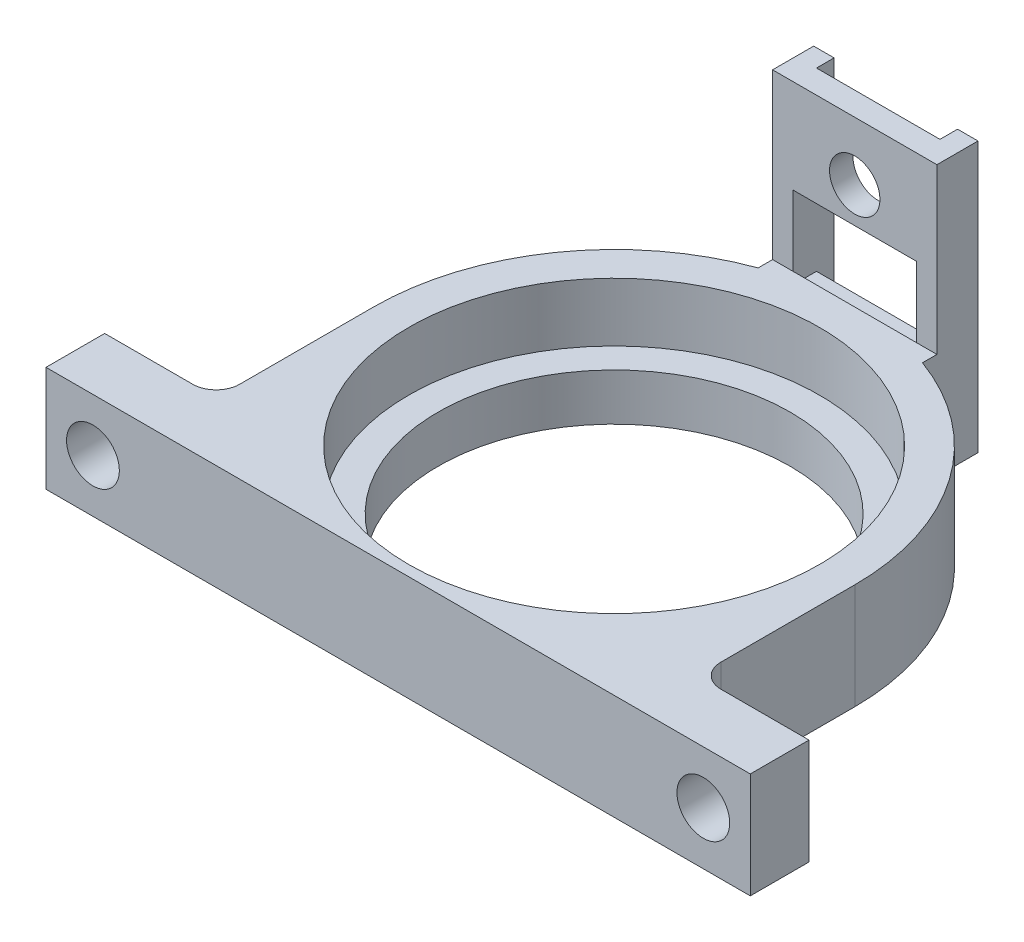
ISO-10303-21;
HEADER;
FILE_DESCRIPTION(('STEP AP214'),'2;1');
FILE_NAME('part.step','',(''),(''),'','','');
FILE_SCHEMA(('AUTOMOTIVE_DESIGN { 1 0 10303 214 1 1 1 1 }'));
ENDSEC;
DATA;
#1=APPLICATION_CONTEXT('core data for automotive mechanical design processes');
#2=APPLICATION_PROTOCOL_DEFINITION('international standard','automotive_design',2000,#1);
#3=PRODUCT_CONTEXT('',#1,'mechanical');
#4=PRODUCT('Part','Part','',(#3));
#5=PRODUCT_RELATED_PRODUCT_CATEGORY('part','',(#4));
#6=PRODUCT_DEFINITION_FORMATION('','',#4);
#7=PRODUCT_DEFINITION_CONTEXT('part definition',#1,'design');
#8=PRODUCT_DEFINITION('design','',#6,#7);
#9=PRODUCT_DEFINITION_SHAPE('','',#8);
#10=(LENGTH_UNIT() NAMED_UNIT(*) SI_UNIT(.MILLI.,.METRE.));
#11=(NAMED_UNIT(*) PLANE_ANGLE_UNIT() SI_UNIT($,.RADIAN.));
#12=(NAMED_UNIT(*) SI_UNIT($,.STERADIAN.) SOLID_ANGLE_UNIT());
#13=UNCERTAINTY_MEASURE_WITH_UNIT(LENGTH_MEASURE(1.E-05),#10,'distance_accuracy_value','');
#14=(GEOMETRIC_REPRESENTATION_CONTEXT(3) GLOBAL_UNCERTAINTY_ASSIGNED_CONTEXT((#13)) GLOBAL_UNIT_ASSIGNED_CONTEXT((#10,
#11,#12)) REPRESENTATION_CONTEXT('',''));
#15=CARTESIAN_POINT('',(0.,0.,0.));
#16=DIRECTION('',(0.,0.,1.));
#17=DIRECTION('',(1.,0.,0.));
#18=AXIS2_PLACEMENT_3D('',#15,#16,#17);
#19=CARTESIAN_POINT('',(5.26,19.7781343320499,-40.9));
#20=DIRECTION('',(0.,0.,-1.));
#21=DIRECTION('',(-1.,0.,0.));
#22=AXIS2_PLACEMENT_3D('',#19,#20,#21);
#23=PLANE('',#22);
#24=DIRECTION('',(1.,0.,0.));
#25=VECTOR('',#24,1.);
#26=CARTESIAN_POINT('',(5.26,11.,-40.9));
#27=LINE('',#26,#25);
#28=CARTESIAN_POINT('',(-5.26,11.,-40.9));
#29=VERTEX_POINT('',#28);
#30=CARTESIAN_POINT('',(5.26,11.,-40.9));
#31=VERTEX_POINT('',#30);
#32=EDGE_CURVE('E50',#29,#31,#27,.T.);
#33=ORIENTED_EDGE('',*,*,#32,.F.);
#34=DIRECTION('',(0.,-1.,0.));
#35=VECTOR('',#34,1.);
#36=CARTESIAN_POINT('',(-5.26,19.7781343320499,-40.9));
#37=LINE('',#36,#35);
#38=CARTESIAN_POINT('',(-5.26,19.,-40.9));
#39=VERTEX_POINT('',#38);
#40=EDGE_CURVE('E230',#39,#29,#37,.T.);
#41=ORIENTED_EDGE('',*,*,#40,.F.);
#42=DIRECTION('',(-1.,0.,0.));
#43=VECTOR('',#42,1.);
#44=CARTESIAN_POINT('',(-5.26,19.,-40.9));
#45=LINE('',#44,#43);
#46=CARTESIAN_POINT('',(5.26,19.,-40.9));
#47=VERTEX_POINT('',#46);
#48=EDGE_CURVE('E373',#47,#39,#45,.T.);
#49=ORIENTED_EDGE('',*,*,#48,.F.);
#50=DIRECTION('',(0.,-1.,0.));
#51=VECTOR('',#50,1.);
#52=CARTESIAN_POINT('',(5.26,19.7781343320499,-40.9));
#53=LINE('',#52,#51);
#54=EDGE_CURVE('E229',#47,#31,#53,.T.);
#55=ORIENTED_EDGE('',*,*,#54,.T.);
#56=EDGE_LOOP('',(#33,#41,#49,#55));
#57=FACE_BOUND('',#56,.T.);
#58=CARTESIAN_POINT('',(0.,14.,-40.9));
#59=DIRECTION('',(0.,0.,-1.));
#60=DIRECTION('',(-1.,0.,0.));
#61=AXIS2_PLACEMENT_3D('',#58,#59,#60);
#62=CIRCLE('',#61,2.1463);
#63=CARTESIAN_POINT('',(-2.1463,14.,-40.9));
#64=VERTEX_POINT('',#63);
#65=EDGE_CURVE('E351',#64,#64,#62,.T.);
#66=ORIENTED_EDGE('',*,*,#65,.F.);
#67=EDGE_LOOP('',(#66));
#68=FACE_BOUND('',#67,.T.);
#69=ADVANCED_FACE('F35',(#57,#68),#23,.T.);
#70=CARTESIAN_POINT('',(0.,5.,-18.4));
#71=DIRECTION('',(0.,-1.,0.));
#72=DIRECTION('',(0.,0.,-1.));
#73=AXIS2_PLACEMENT_3D('',#70,#71,#72);
#74=CYLINDRICAL_SURFACE('',#73,20.5);
#75=DIRECTION('',(0.,-1.,0.));
#76=VECTOR('',#75,1.);
#77=CARTESIAN_POINT('',(-7.,19.7781343320499,-37.6678488679977));
#78=LINE('',#77,#76);
#79=CARTESIAN_POINT('',(-7.,5.,-37.6678488679977));
#80=VERTEX_POINT('',#79);
#81=CARTESIAN_POINT('',(-7.,-4.,-37.6678488679977));
#82=VERTEX_POINT('',#81);
#83=EDGE_CURVE('E243',#80,#82,#78,.T.);
#84=ORIENTED_EDGE('',*,*,#83,.T.);
#85=CARTESIAN_POINT('',(0.,-4.,-18.4));
#86=DIRECTION('',(0.,-1.,0.));
#87=DIRECTION('',(0.,0.,-1.));
#88=AXIS2_PLACEMENT_3D('',#85,#86,#87);
#89=CIRCLE('',#88,20.5);
#90=CARTESIAN_POINT('',(-20.5,-4.,-18.4));
#91=VERTEX_POINT('',#90);
#92=EDGE_CURVE('E264',#91,#82,#89,.T.);
#93=ORIENTED_EDGE('',*,*,#92,.F.);
#94=DIRECTION('',(0.,-1.,0.));
#95=VECTOR('',#94,1.);
#96=CARTESIAN_POINT('',(-20.5,5.,-18.4));
#97=LINE('',#96,#95);
#98=CARTESIAN_POINT('',(-20.5,5.,-18.4));
#99=VERTEX_POINT('',#98);
#100=EDGE_CURVE('E327',#99,#91,#97,.T.);
#101=ORIENTED_EDGE('',*,*,#100,.F.);
#102=CARTESIAN_POINT('',(0.,5.,-18.4));
#103=DIRECTION('',(0.,1.,0.));
#104=DIRECTION('',(0.,0.,1.));
#105=AXIS2_PLACEMENT_3D('',#102,#103,#104);
#106=CIRCLE('',#105,20.5);
#107=EDGE_CURVE('E291',#99,#80,#106,.F.);
#108=ORIENTED_EDGE('',*,*,#107,.T.);
#109=EDGE_LOOP('',(#84,#93,#101,#108));
#110=FACE_BOUND('',#109,.T.);
#111=ADVANCED_FACE('F462',(#110),#74,.T.);
#112=CARTESIAN_POINT('',(0.,5.,-5.));
#113=DIRECTION('',(0.,0.,1.));
#114=DIRECTION('',(1.,0.,0.));
#115=AXIS2_PLACEMENT_3D('',#112,#113,#114);
#116=PLANE('',#115);
#117=DIRECTION('',(-1.,0.,0.));
#118=VECTOR('',#117,1.);
#119=CARTESIAN_POINT('',(0.,5.,-5.));
#120=LINE('',#119,#118);
#121=CARTESIAN_POINT('',(-22.5,5.,-5.));
#122=VERTEX_POINT('',#121);
#123=CARTESIAN_POINT('',(-30.,5.,-5.));
#124=VERTEX_POINT('',#123);
#125=EDGE_CURVE('E297',#122,#124,#120,.T.);
#126=ORIENTED_EDGE('',*,*,#125,.F.);
#127=DIRECTION('',(0.,-1.,0.));
#128=VECTOR('',#127,1.);
#129=CARTESIAN_POINT('',(-22.5,-4.,-5.));
#130=LINE('',#129,#128);
#131=CARTESIAN_POINT('',(-22.5,-4.,-5.));
#132=VERTEX_POINT('',#131);
#133=EDGE_CURVE('E330',#122,#132,#130,.T.);
#134=ORIENTED_EDGE('',*,*,#133,.T.);
#135=DIRECTION('',(1.,0.,0.));
#136=VECTOR('',#135,1.);
#137=CARTESIAN_POINT('',(-20.5,-4.,-5.));
#138=LINE('',#137,#136);
#139=CARTESIAN_POINT('',(-30.,-4.,-5.));
#140=VERTEX_POINT('',#139);
#141=EDGE_CURVE('E281',#140,#132,#138,.T.);
#142=ORIENTED_EDGE('',*,*,#141,.F.);
#143=DIRECTION('',(0.,-1.,0.));
#144=VECTOR('',#143,1.);
#145=CARTESIAN_POINT('',(-30.,5.,-5.));
#146=LINE('',#145,#144);
#147=EDGE_CURVE('E325',#124,#140,#146,.T.);
#148=ORIENTED_EDGE('',*,*,#147,.F.);
#149=EDGE_LOOP('',(#126,#134,#142,#148));
#150=FACE_BOUND('',#149,.T.);
#151=CARTESIAN_POINT('',(-26.,0.5,-5.));
#152=DIRECTION('',(0.,0.,-1.));
#153=DIRECTION('',(-1.,0.,0.));
#154=AXIS2_PLACEMENT_3D('',#151,#152,#153);
#155=CIRCLE('',#154,2.2479);
#156=CARTESIAN_POINT('',(-28.2479,0.5,-5.));
#157=VERTEX_POINT('',#156);
#158=EDGE_CURVE('E251',#157,#157,#155,.T.);
#159=ORIENTED_EDGE('',*,*,#158,.F.);
#160=EDGE_LOOP('',(#159));
#161=FACE_BOUND('',#160,.T.);
#162=ADVANCED_FACE('F475',(#150,#161),#116,.F.);
#163=DIRECTION('',(0.,-1.,0.));
#164=VECTOR('',#163,1.);
#165=CARTESIAN_POINT('',(7.,19.7781343320499,-37.6678488679977));
#166=LINE('',#165,#164);
#167=CARTESIAN_POINT('',(7.,5.,-37.6678488679977));
#168=VERTEX_POINT('',#167);
#169=CARTESIAN_POINT('',(7.,-4.,-37.6678488679977));
#170=VERTEX_POINT('',#169);
#171=EDGE_CURVE('E247',#168,#170,#166,.T.);
#172=ORIENTED_EDGE('',*,*,#171,.F.);
#173=CARTESIAN_POINT('',(20.5,5.,-18.4));
#174=VERTEX_POINT('',#173);
#175=EDGE_CURVE('E290',#168,#174,#106,.F.);
#176=ORIENTED_EDGE('',*,*,#175,.T.);
#177=DIRECTION('',(0.,-1.,0.));
#178=VECTOR('',#177,1.);
#179=CARTESIAN_POINT('',(20.5,5.,-18.4));
#180=LINE('',#179,#178);
#181=CARTESIAN_POINT('',(20.5,-4.,-18.4));
#182=VERTEX_POINT('',#181);
#183=EDGE_CURVE('E313',#174,#182,#180,.T.);
#184=ORIENTED_EDGE('',*,*,#183,.T.);
#185=EDGE_CURVE('E261',#170,#182,#89,.T.);
#186=ORIENTED_EDGE('',*,*,#185,.F.);
#187=EDGE_LOOP('',(#172,#176,#184,#186));
#188=FACE_BOUND('',#187,.T.);
#189=ADVANCED_FACE('F505',(#188),#74,.T.);
#190=CARTESIAN_POINT('',(-20.5,5.,0.));
#191=DIRECTION('',(1.,0.,0.));
#192=DIRECTION('',(0.,0.,-1.));
#193=AXIS2_PLACEMENT_3D('',#190,#191,#192);
#194=PLANE('',#193);
#195=DIRECTION('',(0.,0.,-1.));
#196=VECTOR('',#195,1.);
#197=CARTESIAN_POINT('',(-20.5,-4.,-18.4));
#198=LINE('',#197,#196);
#199=CARTESIAN_POINT('',(-20.5,-4.,-7.));
#200=VERTEX_POINT('',#199);
#201=EDGE_CURVE('E284',#200,#91,#198,.T.);
#202=ORIENTED_EDGE('',*,*,#201,.F.);
#203=DIRECTION('',(0.,-1.,0.));
#204=VECTOR('',#203,1.);
#205=CARTESIAN_POINT('',(-20.5,5.,-7.));
#206=LINE('',#205,#204);
#207=CARTESIAN_POINT('',(-20.5,5.,-7.));
#208=VERTEX_POINT('',#207);
#209=EDGE_CURVE('E333',#200,#208,#206,.F.);
#210=ORIENTED_EDGE('',*,*,#209,.T.);
#211=DIRECTION('',(0.,0.,1.));
#212=VECTOR('',#211,1.);
#213=CARTESIAN_POINT('',(-20.5,5.,0.));
#214=LINE('',#213,#212);
#215=EDGE_CURVE('E294',#99,#208,#214,.T.);
#216=ORIENTED_EDGE('',*,*,#215,.F.);
#217=ORIENTED_EDGE('',*,*,#100,.T.);
#218=EDGE_LOOP('',(#202,#210,#216,#217));
#219=FACE_BOUND('',#218,.T.);
#220=ADVANCED_FACE('F466',(#219),#194,.F.);
#221=CARTESIAN_POINT('',(-30.,5.,0.));
#222=DIRECTION('',(-1.,0.,0.));
#223=DIRECTION('',(0.,0.,1.));
#224=AXIS2_PLACEMENT_3D('',#221,#222,#223);
#225=PLANE('',#224);
#226=ORIENTED_EDGE('',*,*,#147,.T.);
#227=DIRECTION('',(0.,0.,-1.));
#228=VECTOR('',#227,1.);
#229=CARTESIAN_POINT('',(-30.,-4.,0.));
#230=LINE('',#229,#228);
#231=CARTESIAN_POINT('',(-30.,-4.,0.));
#232=VERTEX_POINT('',#231);
#233=EDGE_CURVE('E278',#232,#140,#230,.T.);
#234=ORIENTED_EDGE('',*,*,#233,.F.);
#235=DIRECTION('',(0.,-1.,0.));
#236=VECTOR('',#235,1.);
#237=CARTESIAN_POINT('',(-30.,5.,0.));
#238=LINE('',#237,#236);
#239=CARTESIAN_POINT('',(-30.,5.,0.));
#240=VERTEX_POINT('',#239);
#241=EDGE_CURVE('E323',#240,#232,#238,.T.);
#242=ORIENTED_EDGE('',*,*,#241,.F.);
#243=DIRECTION('',(0.,0.,-1.));
#244=VECTOR('',#243,1.);
#245=CARTESIAN_POINT('',(-30.,5.,0.));
#246=LINE('',#245,#244);
#247=EDGE_CURVE('E299',#240,#124,#246,.T.);
#248=ORIENTED_EDGE('',*,*,#247,.T.);
#249=EDGE_LOOP('',(#226,#234,#242,#248));
#250=FACE_BOUND('',#249,.T.);
#251=ADVANCED_FACE('F480',(#250),#225,.T.);
#252=CARTESIAN_POINT('',(0.,5.,0.));
#253=DIRECTION('',(0.,0.,1.));
#254=DIRECTION('',(1.,0.,0.));
#255=AXIS2_PLACEMENT_3D('',#252,#253,#254);
#256=PLANE('',#255);
#257=CARTESIAN_POINT('',(26.,0.5,0.));
#258=DIRECTION('',(0.,0.,1.));
#259=DIRECTION('',(1.,0.,0.));
#260=AXIS2_PLACEMENT_3D('',#257,#258,#259);
#261=CIRCLE('',#260,2.2479);
#262=CARTESIAN_POINT('',(28.2479,0.5,0.));
#263=VERTEX_POINT('',#262);
#264=EDGE_CURVE('E250',#263,#263,#261,.T.);
#265=ORIENTED_EDGE('',*,*,#264,.F.);
#266=EDGE_LOOP('',(#265));
#267=FACE_BOUND('',#266,.T.);
#268=CARTESIAN_POINT('',(-26.,0.5,0.));
#269=DIRECTION('',(0.,0.,1.));
#270=DIRECTION('',(1.,0.,0.));
#271=AXIS2_PLACEMENT_3D('',#268,#269,#270);
#272=CIRCLE('',#271,2.2479);
#273=CARTESIAN_POINT('',(-23.7521,0.5,0.));
#274=VERTEX_POINT('',#273);
#275=EDGE_CURVE('E254',#274,#274,#272,.T.);
#276=ORIENTED_EDGE('',*,*,#275,.F.);
#277=EDGE_LOOP('',(#276));
#278=FACE_BOUND('',#277,.T.);
#279=ORIENTED_EDGE('',*,*,#241,.T.);
#280=DIRECTION('',(-1.,0.,0.));
#281=VECTOR('',#280,1.);
#282=CARTESIAN_POINT('',(30.,-4.,0.));
#283=LINE('',#282,#281);
#284=CARTESIAN_POINT('',(30.,-4.,0.));
#285=VERTEX_POINT('',#284);
#286=EDGE_CURVE('E275',#285,#232,#283,.T.);
#287=ORIENTED_EDGE('',*,*,#286,.F.);
#288=DIRECTION('',(0.,-1.,0.));
#289=VECTOR('',#288,1.);
#290=CARTESIAN_POINT('',(30.,5.,0.));
#291=LINE('',#290,#289);
#292=CARTESIAN_POINT('',(30.,5.,0.));
#293=VERTEX_POINT('',#292);
#294=EDGE_CURVE('E321',#293,#285,#291,.T.);
#295=ORIENTED_EDGE('',*,*,#294,.F.);
#296=DIRECTION('',(-1.,0.,0.));
#297=VECTOR('',#296,1.);
#298=CARTESIAN_POINT('',(0.,5.,0.));
#299=LINE('',#298,#297);
#300=EDGE_CURVE('E302',#293,#240,#299,.T.);
#301=ORIENTED_EDGE('',*,*,#300,.T.);
#302=EDGE_LOOP('',(#279,#287,#295,#301));
#303=FACE_BOUND('',#302,.T.);
#304=ADVANCED_FACE('F483',(#267,#278,#303),#256,.T.);
#305=CARTESIAN_POINT('',(30.,5.,0.));
#306=DIRECTION('',(-1.,0.,0.));
#307=DIRECTION('',(0.,0.,1.));
#308=AXIS2_PLACEMENT_3D('',#305,#306,#307);
#309=PLANE('',#308);
#310=ORIENTED_EDGE('',*,*,#294,.T.);
#311=DIRECTION('',(0.,0.,1.));
#312=VECTOR('',#311,1.);
#313=CARTESIAN_POINT('',(30.,-4.,0.));
#314=LINE('',#313,#312);
#315=CARTESIAN_POINT('',(30.,-4.,-5.));
#316=VERTEX_POINT('',#315);
#317=EDGE_CURVE('E272',#316,#285,#314,.T.);
#318=ORIENTED_EDGE('',*,*,#317,.F.);
#319=DIRECTION('',(0.,-1.,0.));
#320=VECTOR('',#319,1.);
#321=CARTESIAN_POINT('',(30.,5.,-5.));
#322=LINE('',#321,#320);
#323=CARTESIAN_POINT('',(30.,5.,-5.));
#324=VERTEX_POINT('',#323);
#325=EDGE_CURVE('E318',#324,#316,#322,.T.);
#326=ORIENTED_EDGE('',*,*,#325,.F.);
#327=DIRECTION('',(0.,0.,-1.));
#328=VECTOR('',#327,1.);
#329=CARTESIAN_POINT('',(30.,5.,0.));
#330=LINE('',#329,#328);
#331=EDGE_CURVE('E305',#293,#324,#330,.T.);
#332=ORIENTED_EDGE('',*,*,#331,.F.);
#333=EDGE_LOOP('',(#310,#318,#326,#332));
#334=FACE_BOUND('',#333,.T.);
#335=ADVANCED_FACE('F489',(#334),#309,.F.);
#336=CARTESIAN_POINT('',(0.,5.,-5.));
#337=DIRECTION('',(0.,0.,-1.));
#338=DIRECTION('',(-1.,0.,0.));
#339=AXIS2_PLACEMENT_3D('',#336,#337,#338);
#340=PLANE('',#339);
#341=CARTESIAN_POINT('',(26.,0.5,-5.));
#342=DIRECTION('',(0.,0.,-1.));
#343=DIRECTION('',(-1.,0.,0.));
#344=AXIS2_PLACEMENT_3D('',#341,#342,#343);
#345=CIRCLE('',#344,2.2479);
#346=CARTESIAN_POINT('',(23.7521,0.5,-5.));
#347=VERTEX_POINT('',#346);
#348=EDGE_CURVE('E246',#347,#347,#345,.T.);
#349=ORIENTED_EDGE('',*,*,#348,.F.);
#350=EDGE_LOOP('',(#349));
#351=FACE_BOUND('',#350,.T.);
#352=DIRECTION('',(1.,0.,0.));
#353=VECTOR('',#352,1.);
#354=CARTESIAN_POINT('',(20.5,-4.,-5.));
#355=LINE('',#354,#353);
#356=CARTESIAN_POINT('',(22.5,-4.,-5.));
#357=VERTEX_POINT('',#356);
#358=EDGE_CURVE('E270',#357,#316,#355,.T.);
#359=ORIENTED_EDGE('',*,*,#358,.F.);
#360=DIRECTION('',(0.,-1.,0.));
#361=VECTOR('',#360,1.);
#362=CARTESIAN_POINT('',(22.5,5.,-5.));
#363=LINE('',#362,#361);
#364=CARTESIAN_POINT('',(22.5,5.,-5.));
#365=VERTEX_POINT('',#364);
#366=EDGE_CURVE('E338',#357,#365,#363,.F.);
#367=ORIENTED_EDGE('',*,*,#366,.T.);
#368=DIRECTION('',(1.,0.,0.));
#369=VECTOR('',#368,1.);
#370=CARTESIAN_POINT('',(0.,5.,-5.));
#371=LINE('',#370,#369);
#372=EDGE_CURVE('E308',#365,#324,#371,.T.);
#373=ORIENTED_EDGE('',*,*,#372,.T.);
#374=ORIENTED_EDGE('',*,*,#325,.T.);
#375=EDGE_LOOP('',(#359,#367,#373,#374));
#376=FACE_BOUND('',#375,.T.);
#377=ADVANCED_FACE('F519',(#351,#376),#340,.T.);
#378=CARTESIAN_POINT('',(0.,5.,-18.4));
#379=DIRECTION('',(0.,-1.,0.));
#380=DIRECTION('',(0.,0.,-1.));
#381=AXIS2_PLACEMENT_3D('',#378,#379,#380);
#382=CYLINDRICAL_SURFACE('',#381,17.5);
#383=CARTESIAN_POINT('',(0.,5.,-18.4));
#384=DIRECTION('',(0.,1.,0.));
#385=DIRECTION('',(0.,0.,1.));
#386=AXIS2_PLACEMENT_3D('',#383,#384,#385);
#387=CIRCLE('',#386,17.5);
#388=CARTESIAN_POINT('',(0.,5.,-0.899999999999998));
#389=VERTEX_POINT('',#388);
#390=EDGE_CURVE('E287',#389,#389,#387,.T.);
#391=ORIENTED_EDGE('',*,*,#390,.T.);
#392=EDGE_LOOP('',(#391));
#393=FACE_BOUND('',#392,.T.);
#394=CARTESIAN_POINT('',(0.,0.,-18.4));
#395=DIRECTION('',(0.,1.,0.));
#396=DIRECTION('',(0.,0.,1.));
#397=AXIS2_PLACEMENT_3D('',#394,#395,#396);
#398=CIRCLE('',#397,17.5);
#399=CARTESIAN_POINT('',(0.,0.,-0.899999999999998));
#400=VERTEX_POINT('',#399);
#401=EDGE_CURVE('E286',#400,#400,#398,.T.);
#402=ORIENTED_EDGE('',*,*,#401,.F.);
#403=EDGE_LOOP('',(#402));
#404=FACE_BOUND('',#403,.T.);
#405=ADVANCED_FACE('F521',(#393,#404),#382,.F.);
#406=CARTESIAN_POINT('',(20.5,5.,0.));
#407=DIRECTION('',(1.,0.,0.));
#408=DIRECTION('',(0.,0.,-1.));
#409=AXIS2_PLACEMENT_3D('',#406,#407,#408);
#410=PLANE('',#409);
#411=DIRECTION('',(0.,0.,1.));
#412=VECTOR('',#411,1.);
#413=CARTESIAN_POINT('',(20.5,5.,0.));
#414=LINE('',#413,#412);
#415=CARTESIAN_POINT('',(20.5,5.,-7.));
#416=VERTEX_POINT('',#415);
#417=EDGE_CURVE('E310',#174,#416,#414,.T.);
#418=ORIENTED_EDGE('',*,*,#417,.T.);
#419=DIRECTION('',(0.,-1.,0.));
#420=VECTOR('',#419,1.);
#421=CARTESIAN_POINT('',(20.5,-4.,-7.));
#422=LINE('',#421,#420);
#423=CARTESIAN_POINT('',(20.5,-4.,-7.));
#424=VERTEX_POINT('',#423);
#425=EDGE_CURVE('E335',#416,#424,#422,.T.);
#426=ORIENTED_EDGE('',*,*,#425,.T.);
#427=DIRECTION('',(0.,0.,1.));
#428=VECTOR('',#427,1.);
#429=CARTESIAN_POINT('',(20.5,-4.,-18.4));
#430=LINE('',#429,#428);
#431=EDGE_CURVE('E267',#182,#424,#430,.T.);
#432=ORIENTED_EDGE('',*,*,#431,.F.);
#433=ORIENTED_EDGE('',*,*,#183,.F.);
#434=EDGE_LOOP('',(#418,#426,#432,#433));
#435=FACE_BOUND('',#434,.T.);
#436=ADVANCED_FACE('F499',(#435),#410,.T.);
#437=CARTESIAN_POINT('',(0.,5.,0.));
#438=DIRECTION('',(0.,1.,0.));
#439=DIRECTION('',(0.,0.,1.));
#440=AXIS2_PLACEMENT_3D('',#437,#438,#439);
#441=PLANE('',#440);
#442=DIRECTION('',(1.,0.,0.));
#443=VECTOR('',#442,1.);
#444=CARTESIAN_POINT('',(-6.99999999999999,5.,-38.9));
#445=LINE('',#444,#443);
#446=CARTESIAN_POINT('',(-7.,5.,-38.9));
#447=VERTEX_POINT('',#446);
#448=CARTESIAN_POINT('',(-5.26,5.,-38.9));
#449=VERTEX_POINT('',#448);
#450=EDGE_CURVE('E356',#447,#449,#445,.T.);
#451=ORIENTED_EDGE('',*,*,#450,.F.);
#452=DIRECTION('',(0.,0.,-1.));
#453=VECTOR('',#452,1.);
#454=CARTESIAN_POINT('',(-6.99999999999999,5.,-42.4));
#455=LINE('',#454,#453);
#456=EDGE_CURVE('E242',#80,#447,#455,.T.);
#457=ORIENTED_EDGE('',*,*,#456,.F.);
#458=ORIENTED_EDGE('',*,*,#107,.F.);
#459=ORIENTED_EDGE('',*,*,#215,.T.);
#460=CARTESIAN_POINT('',(-22.5,5.,-7.));
#461=DIRECTION('',(0.,1.,0.));
#462=DIRECTION('',(0.,0.,1.));
#463=AXIS2_PLACEMENT_3D('',#460,#461,#462);
#464=CIRCLE('',#463,2.);
#465=EDGE_CURVE('E342',#208,#122,#464,.F.);
#466=ORIENTED_EDGE('',*,*,#465,.T.);
#467=ORIENTED_EDGE('',*,*,#125,.T.);
#468=ORIENTED_EDGE('',*,*,#247,.F.);
#469=ORIENTED_EDGE('',*,*,#300,.F.);
#470=ORIENTED_EDGE('',*,*,#331,.T.);
#471=ORIENTED_EDGE('',*,*,#372,.F.);
#472=CARTESIAN_POINT('',(22.5,5.,-7.));
#473=DIRECTION('',(0.,1.,0.));
#474=DIRECTION('',(0.,0.,1.));
#475=AXIS2_PLACEMENT_3D('',#472,#473,#474);
#476=CIRCLE('',#475,2.);
#477=EDGE_CURVE('E43',#365,#416,#476,.F.);
#478=ORIENTED_EDGE('',*,*,#477,.T.);
#479=ORIENTED_EDGE('',*,*,#417,.F.);
#480=ORIENTED_EDGE('',*,*,#175,.F.);
#481=DIRECTION('',(0.,0.,1.));
#482=VECTOR('',#481,1.);
#483=CARTESIAN_POINT('',(7.,5.,-37.6678488679977));
#484=LINE('',#483,#482);
#485=CARTESIAN_POINT('',(7.,5.,-38.9));
#486=VERTEX_POINT('',#485);
#487=EDGE_CURVE('E412',#486,#168,#484,.T.);
#488=ORIENTED_EDGE('',*,*,#487,.F.);
#489=CARTESIAN_POINT('',(5.26,5.,-38.9));
#490=VERTEX_POINT('',#489);
#491=EDGE_CURVE('E350',#490,#486,#445,.T.);
#492=ORIENTED_EDGE('',*,*,#491,.F.);
#493=EDGE_CURVE('E354',#449,#490,#445,.T.);
#494=ORIENTED_EDGE('',*,*,#493,.F.);
#495=EDGE_LOOP('',(#451,#457,#458,#459,#466,#467,#468,#469,#470,#471,#478,#479,#480,#488,#492,#494));
#496=FACE_BOUND('',#495,.T.);
#497=ORIENTED_EDGE('',*,*,#390,.F.);
#498=EDGE_LOOP('',(#497));
#499=FACE_BOUND('',#498,.T.);
#500=ADVANCED_FACE('F446',(#496,#499),#441,.T.);
#501=CARTESIAN_POINT('',(0.,0.,-18.4));
#502=DIRECTION('',(0.,-1.,0.));
#503=DIRECTION('',(0.,0.,-1.));
#504=AXIS2_PLACEMENT_3D('',#501,#502,#503);
#505=PLANE('',#504);
#506=CARTESIAN_POINT('',(0.,0.,-18.4));
#507=DIRECTION('',(0.,-1.,0.));
#508=DIRECTION('',(0.,0.,-1.));
#509=AXIS2_PLACEMENT_3D('',#506,#507,#508);
#510=CIRCLE('',#509,15.);
#511=CARTESIAN_POINT('',(0.,0.,-33.4));
#512=VERTEX_POINT('',#511);
#513=EDGE_CURVE('E257',#512,#512,#510,.T.);
#514=ORIENTED_EDGE('',*,*,#513,.T.);
#515=EDGE_LOOP('',(#514));
#516=FACE_BOUND('',#515,.T.);
#517=ORIENTED_EDGE('',*,*,#401,.T.);
#518=EDGE_LOOP('',(#517));
#519=FACE_BOUND('',#518,.T.);
#520=ADVANCED_FACE('F571',(#516,#519),#505,.F.);
#521=CARTESIAN_POINT('',(0.,-4.,-18.4));
#522=DIRECTION('',(0.,-1.,0.));
#523=DIRECTION('',(0.,0.,-1.));
#524=AXIS2_PLACEMENT_3D('',#521,#522,#523);
#525=PLANE('',#524);
#526=ORIENTED_EDGE('',*,*,#92,.T.);
#527=DIRECTION('',(0.,0.,-1.));
#528=VECTOR('',#527,1.);
#529=CARTESIAN_POINT('',(-6.99999999999999,-4.,-42.4));
#530=LINE('',#529,#528);
#531=CARTESIAN_POINT('',(-6.99999999999999,-4.,-42.4));
#532=VERTEX_POINT('',#531);
#533=EDGE_CURVE('E393',#82,#532,#530,.T.);
#534=ORIENTED_EDGE('',*,*,#533,.T.);
#535=DIRECTION('',(1.,0.,0.));
#536=VECTOR('',#535,1.);
#537=CARTESIAN_POINT('',(-5.26,-4.,-42.4));
#538=LINE('',#537,#536);
#539=CARTESIAN_POINT('',(-5.26,-4.,-42.4));
#540=VERTEX_POINT('',#539);
#541=EDGE_CURVE('E405',#532,#540,#538,.T.);
#542=ORIENTED_EDGE('',*,*,#541,.T.);
#543=DIRECTION('',(0.,0.,1.));
#544=VECTOR('',#543,1.);
#545=CARTESIAN_POINT('',(-5.26,-4.,-40.9));
#546=LINE('',#545,#544);
#547=CARTESIAN_POINT('',(-5.26,-4.,-40.9));
#548=VERTEX_POINT('',#547);
#549=EDGE_CURVE('E402',#540,#548,#546,.T.);
#550=ORIENTED_EDGE('',*,*,#549,.T.);
#551=DIRECTION('',(1.,0.,0.));
#552=VECTOR('',#551,1.);
#553=CARTESIAN_POINT('',(5.26,-4.,-40.9));
#554=LINE('',#553,#552);
#555=CARTESIAN_POINT('',(5.26,-4.,-40.9));
#556=VERTEX_POINT('',#555);
#557=EDGE_CURVE('E400',#548,#556,#554,.T.);
#558=ORIENTED_EDGE('',*,*,#557,.T.);
#559=DIRECTION('',(0.,0.,-1.));
#560=VECTOR('',#559,1.);
#561=CARTESIAN_POINT('',(5.26,-4.,-42.4));
#562=LINE('',#561,#560);
#563=CARTESIAN_POINT('',(5.26,-4.,-42.4));
#564=VERTEX_POINT('',#563);
#565=EDGE_CURVE('E227',#556,#564,#562,.T.);
#566=ORIENTED_EDGE('',*,*,#565,.T.);
#567=DIRECTION('',(1.,0.,0.));
#568=VECTOR('',#567,1.);
#569=CARTESIAN_POINT('',(7.,-4.,-42.4));
#570=LINE('',#569,#568);
#571=CARTESIAN_POINT('',(7.,-4.,-42.4));
#572=VERTEX_POINT('',#571);
#573=EDGE_CURVE('E396',#564,#572,#570,.T.);
#574=ORIENTED_EDGE('',*,*,#573,.T.);
#575=DIRECTION('',(0.,0.,1.));
#576=VECTOR('',#575,1.);
#577=CARTESIAN_POINT('',(7.,-4.,-37.6678488679977));
#578=LINE('',#577,#576);
#579=EDGE_CURVE('E394',#572,#170,#578,.T.);
#580=ORIENTED_EDGE('',*,*,#579,.T.);
#581=ORIENTED_EDGE('',*,*,#185,.T.);
#582=ORIENTED_EDGE('',*,*,#431,.T.);
#583=CARTESIAN_POINT('',(22.5,-4.,-7.));
#584=DIRECTION('',(0.,-1.,0.));
#585=DIRECTION('',(0.,0.,-1.));
#586=AXIS2_PLACEMENT_3D('',#583,#584,#585);
#587=CIRCLE('',#586,2.);
#588=EDGE_CURVE('E344',#424,#357,#587,.F.);
#589=ORIENTED_EDGE('',*,*,#588,.T.);
#590=ORIENTED_EDGE('',*,*,#358,.T.);
#591=ORIENTED_EDGE('',*,*,#317,.T.);
#592=ORIENTED_EDGE('',*,*,#286,.T.);
#593=ORIENTED_EDGE('',*,*,#233,.T.);
#594=ORIENTED_EDGE('',*,*,#141,.T.);
#595=CARTESIAN_POINT('',(-22.5,-4.,-7.));
#596=DIRECTION('',(0.,-1.,0.));
#597=DIRECTION('',(0.,0.,-1.));
#598=AXIS2_PLACEMENT_3D('',#595,#596,#597);
#599=CIRCLE('',#598,2.);
#600=EDGE_CURVE('E340',#132,#200,#599,.F.);
#601=ORIENTED_EDGE('',*,*,#600,.T.);
#602=ORIENTED_EDGE('',*,*,#201,.T.);
#603=EDGE_LOOP('',(#526,#534,#542,#550,#558,#566,#574,#580,#581,#582,#589,#590,#591,#592,#593,
#594,#601,#602));
#604=FACE_BOUND('',#603,.T.);
#605=CARTESIAN_POINT('',(0.,-4.,-18.4));
#606=DIRECTION('',(0.,-1.,0.));
#607=DIRECTION('',(0.,0.,-1.));
#608=AXIS2_PLACEMENT_3D('',#605,#606,#607);
#609=CIRCLE('',#608,15.);
#610=CARTESIAN_POINT('',(0.,-4.,-33.4));
#611=VERTEX_POINT('',#610);
#612=EDGE_CURVE('E258',#611,#611,#609,.T.);
#613=ORIENTED_EDGE('',*,*,#612,.F.);
#614=EDGE_LOOP('',(#613));
#615=FACE_BOUND('',#614,.T.);
#616=ADVANCED_FACE('F423',(#604,#615),#525,.T.);
#617=CARTESIAN_POINT('',(0.,-4.,-18.4));
#618=DIRECTION('',(0.,1.,0.));
#619=DIRECTION('',(0.,0.,1.));
#620=AXIS2_PLACEMENT_3D('',#617,#618,#619);
#621=CYLINDRICAL_SURFACE('',#620,15.);
#622=ORIENTED_EDGE('',*,*,#612,.T.);
#623=EDGE_LOOP('',(#622));
#624=FACE_BOUND('',#623,.T.);
#625=ORIENTED_EDGE('',*,*,#513,.F.);
#626=EDGE_LOOP('',(#625));
#627=FACE_BOUND('',#626,.T.);
#628=ADVANCED_FACE('F565',(#624,#627),#621,.F.);
#629=CARTESIAN_POINT('',(-22.5,5.,-7.));
#630=DIRECTION('',(0.,1.,0.));
#631=DIRECTION('',(0.,0.,1.));
#632=AXIS2_PLACEMENT_3D('',#629,#630,#631);
#633=CYLINDRICAL_SURFACE('',#632,2.);
#634=ORIENTED_EDGE('',*,*,#465,.F.);
#635=ORIENTED_EDGE('',*,*,#209,.F.);
#636=ORIENTED_EDGE('',*,*,#600,.F.);
#637=ORIENTED_EDGE('',*,*,#133,.F.);
#638=EDGE_LOOP('',(#634,#635,#636,#637));
#639=FACE_BOUND('',#638,.T.);
#640=ADVANCED_FACE('F469',(#639),#633,.F.);
#641=CARTESIAN_POINT('',(22.5,5.,-7.));
#642=DIRECTION('',(0.,1.,0.));
#643=DIRECTION('',(0.,0.,1.));
#644=AXIS2_PLACEMENT_3D('',#641,#642,#643);
#645=CYLINDRICAL_SURFACE('',#644,2.);
#646=ORIENTED_EDGE('',*,*,#477,.F.);
#647=ORIENTED_EDGE('',*,*,#366,.F.);
#648=ORIENTED_EDGE('',*,*,#588,.F.);
#649=ORIENTED_EDGE('',*,*,#425,.F.);
#650=EDGE_LOOP('',(#646,#647,#648,#649));
#651=FACE_BOUND('',#650,.T.);
#652=ADVANCED_FACE('F37',(#651),#645,.F.);
#653=CARTESIAN_POINT('',(-26.,0.5,-5.));
#654=DIRECTION('',(0.,0.,-1.));
#655=DIRECTION('',(-1.,0.,0.));
#656=AXIS2_PLACEMENT_3D('',#653,#654,#655);
#657=CYLINDRICAL_SURFACE('',#656,2.2479);
#658=ORIENTED_EDGE('',*,*,#275,.T.);
#659=EDGE_LOOP('',(#658));
#660=FACE_BOUND('',#659,.T.);
#661=ORIENTED_EDGE('',*,*,#158,.T.);
#662=EDGE_LOOP('',(#661));
#663=FACE_BOUND('',#662,.T.);
#664=ADVANCED_FACE('F560',(#660,#663),#657,.F.);
#665=CARTESIAN_POINT('',(26.,0.5,-5.));
#666=DIRECTION('',(0.,0.,-1.));
#667=DIRECTION('',(-1.,0.,0.));
#668=AXIS2_PLACEMENT_3D('',#665,#666,#667);
#669=CYLINDRICAL_SURFACE('',#668,2.2479);
#670=ORIENTED_EDGE('',*,*,#264,.T.);
#671=EDGE_LOOP('',(#670));
#672=FACE_BOUND('',#671,.T.);
#673=ORIENTED_EDGE('',*,*,#348,.T.);
#674=EDGE_LOOP('',(#673));
#675=FACE_BOUND('',#674,.T.);
#676=ADVANCED_FACE('F557',(#672,#675),#669,.F.);
#677=CARTESIAN_POINT('',(-6.99999999999999,19.7781343320499,-42.4));
#678=DIRECTION('',(-1.,0.,0.));
#679=DIRECTION('',(0.,0.,1.));
#680=AXIS2_PLACEMENT_3D('',#677,#678,#679);
#681=PLANE('',#680);
#682=ORIENTED_EDGE('',*,*,#83,.F.);
#683=ORIENTED_EDGE('',*,*,#456,.T.);
#684=DIRECTION('',(0.,-1.,0.));
#685=VECTOR('',#684,1.);
#686=CARTESIAN_POINT('',(-6.99999999999999,19.,-38.9));
#687=LINE('',#686,#685);
#688=CARTESIAN_POINT('',(-6.99999999999999,19.,-38.9));
#689=VERTEX_POINT('',#688);
#690=EDGE_CURVE('E390',#689,#447,#687,.T.);
#691=ORIENTED_EDGE('',*,*,#690,.F.);
#692=DIRECTION('',(0.,0.,1.));
#693=VECTOR('',#692,1.);
#694=CARTESIAN_POINT('',(-6.99999999999999,19.,-42.4));
#695=LINE('',#694,#693);
#696=CARTESIAN_POINT('',(-6.99999999999999,19.,-42.4));
#697=VERTEX_POINT('',#696);
#698=EDGE_CURVE('E382',#697,#689,#695,.T.);
#699=ORIENTED_EDGE('',*,*,#698,.F.);
#700=DIRECTION('',(0.,-1.,0.));
#701=VECTOR('',#700,1.);
#702=CARTESIAN_POINT('',(-6.99999999999999,19.7781343320499,-42.4));
#703=LINE('',#702,#701);
#704=EDGE_CURVE('E240',#697,#532,#703,.T.);
#705=ORIENTED_EDGE('',*,*,#704,.T.);
#706=ORIENTED_EDGE('',*,*,#533,.F.);
#707=EDGE_LOOP('',(#682,#683,#691,#699,#705,#706));
#708=FACE_BOUND('',#707,.T.);
#709=ADVANCED_FACE('F457',(#708),#681,.T.);
#710=CARTESIAN_POINT('',(-5.26,19.7781343320499,-42.4));
#711=DIRECTION('',(0.,0.,-1.));
#712=DIRECTION('',(-1.,0.,0.));
#713=AXIS2_PLACEMENT_3D('',#710,#711,#712);
#714=PLANE('',#713);
#715=ORIENTED_EDGE('',*,*,#704,.F.);
#716=DIRECTION('',(-1.,0.,0.));
#717=VECTOR('',#716,1.);
#718=CARTESIAN_POINT('',(-6.99999999999999,19.,-42.4));
#719=LINE('',#718,#717);
#720=CARTESIAN_POINT('',(-5.26,19.,-42.4));
#721=VERTEX_POINT('',#720);
#722=EDGE_CURVE('E379',#721,#697,#719,.T.);
#723=ORIENTED_EDGE('',*,*,#722,.F.);
#724=DIRECTION('',(0.,-1.,0.));
#725=VECTOR('',#724,1.);
#726=CARTESIAN_POINT('',(-5.26,19.7781343320499,-42.4));
#727=LINE('',#726,#725);
#728=EDGE_CURVE('E238',#721,#540,#727,.T.);
#729=ORIENTED_EDGE('',*,*,#728,.T.);
#730=ORIENTED_EDGE('',*,*,#541,.F.);
#731=EDGE_LOOP('',(#715,#723,#729,#730));
#732=FACE_BOUND('',#731,.T.);
#733=ADVANCED_FACE('F518',(#732),#714,.T.);
#734=CARTESIAN_POINT('',(-5.26,19.7781343320499,-40.9));
#735=DIRECTION('',(1.,0.,0.));
#736=DIRECTION('',(0.,0.,-1.));
#737=AXIS2_PLACEMENT_3D('',#734,#735,#736);
#738=PLANE('',#737);
#739=ORIENTED_EDGE('',*,*,#728,.F.);
#740=DIRECTION('',(0.,0.,-1.));
#741=VECTOR('',#740,1.);
#742=CARTESIAN_POINT('',(-5.26,19.,-42.4));
#743=LINE('',#742,#741);
#744=EDGE_CURVE('E376',#39,#721,#743,.T.);
#745=ORIENTED_EDGE('',*,*,#744,.F.);
#746=ORIENTED_EDGE('',*,*,#40,.T.);
#747=DIRECTION('',(0.,0.,-1.));
#748=VECTOR('',#747,1.);
#749=CARTESIAN_POINT('',(-5.26,11.,-26.263924659927));
#750=LINE('',#749,#748);
#751=CARTESIAN_POINT('',(-5.26,11.,-38.9));
#752=VERTEX_POINT('',#751);
#753=EDGE_CURVE('E57',#752,#29,#750,.T.);
#754=ORIENTED_EDGE('',*,*,#753,.F.);
#755=DIRECTION('',(0.,-1.,0.));
#756=VECTOR('',#755,1.);
#757=CARTESIAN_POINT('',(-5.26,4.,-38.9));
#758=LINE('',#757,#756);
#759=EDGE_CURVE('E439',#752,#449,#758,.T.);
#760=ORIENTED_EDGE('',*,*,#759,.T.);
#761=CARTESIAN_POINT('',(-5.26,4.,-38.9));
#762=VERTEX_POINT('',#761);
#763=EDGE_CURVE('E429',#449,#762,#758,.T.);
#764=ORIENTED_EDGE('',*,*,#763,.T.);
#765=DIRECTION('',(0.,0.,-1.));
#766=VECTOR('',#765,1.);
#767=CARTESIAN_POINT('',(-5.26,4.,-26.263924659927));
#768=LINE('',#767,#766);
#769=CARTESIAN_POINT('',(-5.26,4.,-40.9));
#770=VERTEX_POINT('',#769);
#771=EDGE_CURVE('E216',#762,#770,#768,.T.);
#772=ORIENTED_EDGE('',*,*,#771,.T.);
#773=EDGE_CURVE('E223',#770,#548,#37,.T.);
#774=ORIENTED_EDGE('',*,*,#773,.T.);
#775=ORIENTED_EDGE('',*,*,#549,.F.);
#776=EDGE_LOOP('',(#739,#745,#746,#754,#760,#764,#772,#774,#775));
#777=FACE_BOUND('',#776,.T.);
#778=ADVANCED_FACE('F427',(#777),#738,.T.);
#779=DIRECTION('',(-1.,0.,0.));
#780=VECTOR('',#779,1.);
#781=CARTESIAN_POINT('',(5.26,4.,-40.9));
#782=LINE('',#781,#780);
#783=CARTESIAN_POINT('',(5.26,4.,-40.9));
#784=VERTEX_POINT('',#783);
#785=EDGE_CURVE('E208',#784,#770,#782,.T.);
#786=ORIENTED_EDGE('',*,*,#785,.F.);
#787=EDGE_CURVE('E221',#784,#556,#53,.T.);
#788=ORIENTED_EDGE('',*,*,#787,.T.);
#789=ORIENTED_EDGE('',*,*,#557,.F.);
#790=ORIENTED_EDGE('',*,*,#773,.F.);
#791=EDGE_LOOP('',(#786,#788,#789,#790));
#792=FACE_BOUND('',#791,.T.);
#793=ADVANCED_FACE('F219',(#792),#23,.T.);
#794=CARTESIAN_POINT('',(5.26,19.7781343320499,-42.4));
#795=DIRECTION('',(-1.,0.,0.));
#796=DIRECTION('',(0.,0.,1.));
#797=AXIS2_PLACEMENT_3D('',#794,#795,#796);
#798=PLANE('',#797);
#799=ORIENTED_EDGE('',*,*,#54,.F.);
#800=DIRECTION('',(0.,0.,1.));
#801=VECTOR('',#800,1.);
#802=CARTESIAN_POINT('',(5.26,19.,-40.9));
#803=LINE('',#802,#801);
#804=CARTESIAN_POINT('',(5.26,19.,-42.4));
#805=VERTEX_POINT('',#804);
#806=EDGE_CURVE('E370',#805,#47,#803,.T.);
#807=ORIENTED_EDGE('',*,*,#806,.F.);
#808=DIRECTION('',(0.,-1.,0.));
#809=VECTOR('',#808,1.);
#810=CARTESIAN_POINT('',(5.26,19.7781343320499,-42.4));
#811=LINE('',#810,#809);
#812=EDGE_CURVE('E233',#805,#564,#811,.T.);
#813=ORIENTED_EDGE('',*,*,#812,.T.);
#814=ORIENTED_EDGE('',*,*,#565,.F.);
#815=ORIENTED_EDGE('',*,*,#787,.F.);
#816=DIRECTION('',(0.,0.,-1.));
#817=VECTOR('',#816,1.);
#818=CARTESIAN_POINT('',(5.26,4.,-26.263924659927));
#819=LINE('',#818,#817);
#820=CARTESIAN_POINT('',(5.26,4.,-38.9));
#821=VERTEX_POINT('',#820);
#822=EDGE_CURVE('E204',#821,#784,#819,.T.);
#823=ORIENTED_EDGE('',*,*,#822,.F.);
#824=DIRECTION('',(0.,1.,0.));
#825=VECTOR('',#824,1.);
#826=CARTESIAN_POINT('',(5.26,4.,-38.9));
#827=LINE('',#826,#825);
#828=EDGE_CURVE('E361',#821,#490,#827,.T.);
#829=ORIENTED_EDGE('',*,*,#828,.T.);
#830=DIRECTION('',(0.,-1.,0.));
#831=VECTOR('',#830,1.);
#832=CARTESIAN_POINT('',(5.26,19.,-38.9));
#833=LINE('',#832,#831);
#834=CARTESIAN_POINT('',(5.26,11.,-38.9));
#835=VERTEX_POINT('',#834);
#836=EDGE_CURVE('E11',#835,#490,#833,.T.);
#837=ORIENTED_EDGE('',*,*,#836,.F.);
#838=DIRECTION('',(0.,0.,-1.));
#839=VECTOR('',#838,1.);
#840=CARTESIAN_POINT('',(5.26,11.,-26.263924659927));
#841=LINE('',#840,#839);
#842=EDGE_CURVE('E431',#835,#31,#841,.T.);
#843=ORIENTED_EDGE('',*,*,#842,.T.);
#844=EDGE_LOOP('',(#799,#807,#813,#814,#815,#823,#829,#837,#843));
#845=FACE_BOUND('',#844,.T.);
#846=ADVANCED_FACE('F225',(#845),#798,.T.);
#847=CARTESIAN_POINT('',(7.,19.7781343320499,-42.4));
#848=DIRECTION('',(0.,0.,-1.));
#849=DIRECTION('',(-1.,0.,0.));
#850=AXIS2_PLACEMENT_3D('',#847,#848,#849);
#851=PLANE('',#850);
#852=ORIENTED_EDGE('',*,*,#812,.F.);
#853=DIRECTION('',(-1.,0.,0.));
#854=VECTOR('',#853,1.);
#855=CARTESIAN_POINT('',(5.26,19.,-42.4));
#856=LINE('',#855,#854);
#857=CARTESIAN_POINT('',(7.,19.,-42.4));
#858=VERTEX_POINT('',#857);
#859=EDGE_CURVE('E367',#858,#805,#856,.T.);
#860=ORIENTED_EDGE('',*,*,#859,.F.);
#861=DIRECTION('',(0.,-1.,0.));
#862=VECTOR('',#861,1.);
#863=CARTESIAN_POINT('',(7.,19.7781343320499,-42.4));
#864=LINE('',#863,#862);
#865=EDGE_CURVE('E414',#858,#572,#864,.T.);
#866=ORIENTED_EDGE('',*,*,#865,.T.);
#867=ORIENTED_EDGE('',*,*,#573,.F.);
#868=EDGE_LOOP('',(#852,#860,#866,#867));
#869=FACE_BOUND('',#868,.T.);
#870=ADVANCED_FACE('F420',(#869),#851,.T.);
#871=CARTESIAN_POINT('',(7.,19.7781343320499,-37.6678488679977));
#872=DIRECTION('',(1.,0.,0.));
#873=DIRECTION('',(0.,0.,-1.));
#874=AXIS2_PLACEMENT_3D('',#871,#872,#873);
#875=PLANE('',#874);
#876=ORIENTED_EDGE('',*,*,#865,.F.);
#877=DIRECTION('',(0.,0.,-1.));
#878=VECTOR('',#877,1.);
#879=CARTESIAN_POINT('',(7.,19.,-38.9));
#880=LINE('',#879,#878);
#881=CARTESIAN_POINT('',(7.,19.,-38.9));
#882=VERTEX_POINT('',#881);
#883=EDGE_CURVE('E364',#882,#858,#880,.T.);
#884=ORIENTED_EDGE('',*,*,#883,.F.);
#885=DIRECTION('',(0.,-1.,0.));
#886=VECTOR('',#885,1.);
#887=CARTESIAN_POINT('',(7.,19.,-38.9));
#888=LINE('',#887,#886);
#889=EDGE_CURVE('E385',#882,#486,#888,.T.);
#890=ORIENTED_EDGE('',*,*,#889,.T.);
#891=ORIENTED_EDGE('',*,*,#487,.T.);
#892=ORIENTED_EDGE('',*,*,#171,.T.);
#893=ORIENTED_EDGE('',*,*,#579,.F.);
#894=EDGE_LOOP('',(#876,#884,#890,#891,#892,#893));
#895=FACE_BOUND('',#894,.T.);
#896=ADVANCED_FACE('F509',(#895),#875,.T.);
#897=CARTESIAN_POINT('',(-6.99999999999999,19.,-38.9));
#898=DIRECTION('',(0.,0.,-1.));
#899=DIRECTION('',(-1.,0.,0.));
#900=AXIS2_PLACEMENT_3D('',#897,#898,#899);
#901=PLANE('',#900);
#902=CARTESIAN_POINT('',(0.,14.,-38.9));
#903=DIRECTION('',(0.,0.,-1.));
#904=DIRECTION('',(-1.,0.,0.));
#905=AXIS2_PLACEMENT_3D('',#902,#903,#904);
#906=CIRCLE('',#905,2.1463);
#907=CARTESIAN_POINT('',(-2.1463,14.,-38.9));
#908=VERTEX_POINT('',#907);
#909=EDGE_CURVE('E348',#908,#908,#906,.T.);
#910=ORIENTED_EDGE('',*,*,#909,.T.);
#911=EDGE_LOOP('',(#910));
#912=FACE_BOUND('',#911,.T.);
#913=DIRECTION('',(-1.,0.,0.));
#914=VECTOR('',#913,1.);
#915=CARTESIAN_POINT('',(5.26,11.,-38.9));
#916=LINE('',#915,#914);
#917=EDGE_CURVE('E437',#835,#752,#916,.T.);
#918=ORIENTED_EDGE('',*,*,#917,.F.);
#919=ORIENTED_EDGE('',*,*,#836,.T.);
#920=ORIENTED_EDGE('',*,*,#491,.T.);
#921=ORIENTED_EDGE('',*,*,#889,.F.);
#922=DIRECTION('',(1.,0.,0.));
#923=VECTOR('',#922,1.);
#924=CARTESIAN_POINT('',(-6.99999999999999,19.,-38.9));
#925=LINE('',#924,#923);
#926=EDGE_CURVE('E384',#689,#882,#925,.T.);
#927=ORIENTED_EDGE('',*,*,#926,.F.);
#928=ORIENTED_EDGE('',*,*,#690,.T.);
#929=ORIENTED_EDGE('',*,*,#450,.T.);
#930=ORIENTED_EDGE('',*,*,#759,.F.);
#931=EDGE_LOOP('',(#918,#919,#920,#921,#927,#928,#929,#930));
#932=FACE_BOUND('',#931,.T.);
#933=ADVANCED_FACE('F450',(#912,#932),#901,.F.);
#934=CARTESIAN_POINT('',(0.,19.,0.));
#935=DIRECTION('',(0.,-1.,0.));
#936=DIRECTION('',(0.,0.,-1.));
#937=AXIS2_PLACEMENT_3D('',#934,#935,#936);
#938=PLANE('',#937);
#939=ORIENTED_EDGE('',*,*,#883,.T.);
#940=ORIENTED_EDGE('',*,*,#859,.T.);
#941=ORIENTED_EDGE('',*,*,#806,.T.);
#942=ORIENTED_EDGE('',*,*,#48,.T.);
#943=ORIENTED_EDGE('',*,*,#744,.T.);
#944=ORIENTED_EDGE('',*,*,#722,.T.);
#945=ORIENTED_EDGE('',*,*,#698,.T.);
#946=ORIENTED_EDGE('',*,*,#926,.T.);
#947=EDGE_LOOP('',(#939,#940,#941,#942,#943,#944,#945,#946));
#948=FACE_BOUND('',#947,.T.);
#949=ADVANCED_FACE('F516',(#948),#938,.F.);
#950=CARTESIAN_POINT('',(0.,14.,0.));
#951=DIRECTION('',(0.,0.,-1.));
#952=DIRECTION('',(-1.,0.,0.));
#953=AXIS2_PLACEMENT_3D('',#950,#951,#952);
#954=CYLINDRICAL_SURFACE('',#953,2.1463);
#955=ORIENTED_EDGE('',*,*,#65,.T.);
#956=EDGE_LOOP('',(#955));
#957=FACE_BOUND('',#956,.T.);
#958=ORIENTED_EDGE('',*,*,#909,.F.);
#959=EDGE_LOOP('',(#958));
#960=FACE_BOUND('',#959,.T.);
#961=ADVANCED_FACE('F666',(#957,#960),#954,.F.);
#962=CARTESIAN_POINT('',(5.26,11.,-26.263924659927));
#963=DIRECTION('',(0.,1.,0.));
#964=DIRECTION('',(0.,0.,1.));
#965=AXIS2_PLACEMENT_3D('',#962,#963,#964);
#966=PLANE('',#965);
#967=ORIENTED_EDGE('',*,*,#917,.T.);
#968=ORIENTED_EDGE('',*,*,#753,.T.);
#969=ORIENTED_EDGE('',*,*,#32,.T.);
#970=ORIENTED_EDGE('',*,*,#842,.F.);
#971=EDGE_LOOP('',(#967,#968,#969,#970));
#972=FACE_BOUND('',#971,.T.);
#973=ADVANCED_FACE('F510',(#972),#966,.F.);
#974=CARTESIAN_POINT('',(5.26,4.,-26.263924659927));
#975=DIRECTION('',(0.,-1.,0.));
#976=DIRECTION('',(0.,0.,-1.));
#977=AXIS2_PLACEMENT_3D('',#974,#975,#976);
#978=PLANE('',#977);
#979=DIRECTION('',(1.,0.,0.));
#980=VECTOR('',#979,1.);
#981=CARTESIAN_POINT('',(5.26,4.,-38.9));
#982=LINE('',#981,#980);
#983=EDGE_CURVE('E211',#762,#821,#982,.T.);
#984=ORIENTED_EDGE('',*,*,#983,.T.);
#985=ORIENTED_EDGE('',*,*,#822,.T.);
#986=ORIENTED_EDGE('',*,*,#785,.T.);
#987=ORIENTED_EDGE('',*,*,#771,.F.);
#988=EDGE_LOOP('',(#984,#985,#986,#987));
#989=FACE_BOUND('',#988,.T.);
#990=ADVANCED_FACE('F206',(#989),#978,.F.);
#991=CARTESIAN_POINT('',(-6.99999999999999,19.,-38.9));
#992=DIRECTION('',(0.,0.,-1.));
#993=DIRECTION('',(-1.,0.,0.));
#994=AXIS2_PLACEMENT_3D('',#991,#992,#993);
#995=PLANE('',#994);
#996=ORIENTED_EDGE('',*,*,#828,.F.);
#997=ORIENTED_EDGE('',*,*,#983,.F.);
#998=ORIENTED_EDGE('',*,*,#763,.F.);
#999=ORIENTED_EDGE('',*,*,#493,.T.);
#1000=EDGE_LOOP('',(#996,#997,#998,#999));
#1001=FACE_BOUND('',#1000,.T.);
#1002=ADVANCED_FACE('F709',(#1001),#995,.T.);
#1003=CLOSED_SHELL('',(#69,#111,#162,#189,#220,#251,#304,#335,#377,#405,#436,#500,#520,#616,
#628,#640,#652,#664,#676,#709,#733,#778,#793,#846,#870,#896,#933,#949,#961,#973,#990,#1002));
#1004=MANIFOLD_SOLID_BREP('B2',#1003);
#1005=ADVANCED_BREP_SHAPE_REPRESENTATION('',(#18,#1004),#14);
#1006=SHAPE_DEFINITION_REPRESENTATION(#9,#1005);
ENDSEC;
END-ISO-10303-21;
